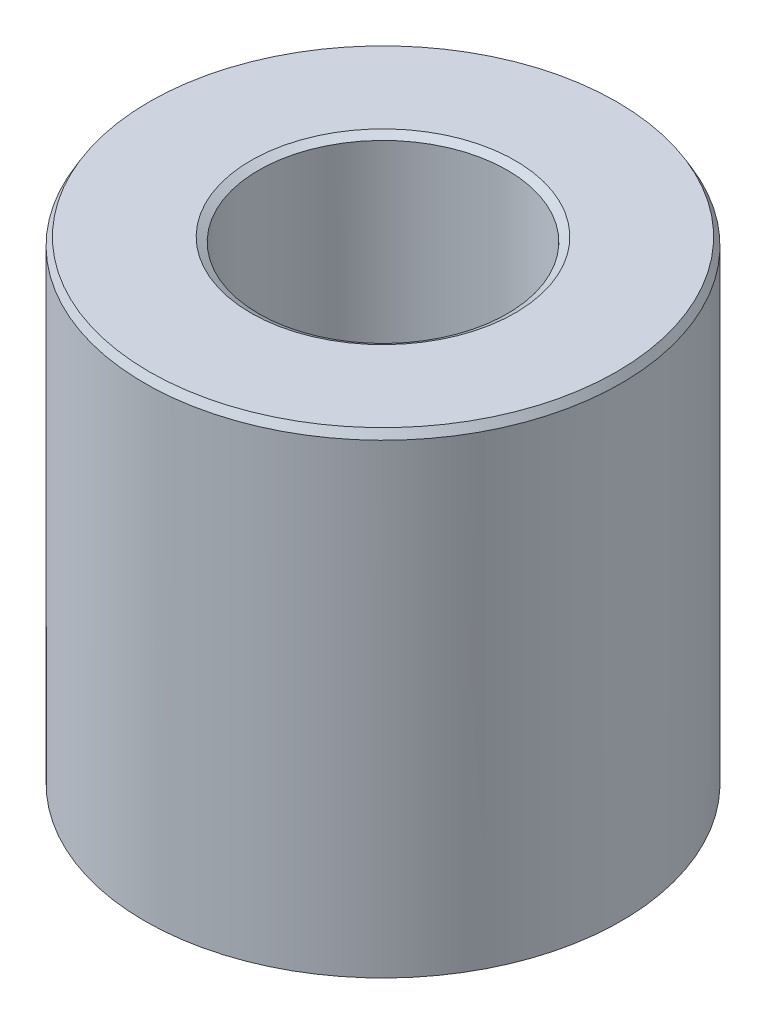
ISO-10303-21;
HEADER;
FILE_DESCRIPTION(('STEP AP214'),'2;1');
FILE_NAME('part.step','',(''),(''),'','','');
FILE_SCHEMA(('AUTOMOTIVE_DESIGN { 1 0 10303 214 1 1 1 1 }'));
ENDSEC;
DATA;
#1=APPLICATION_CONTEXT('core data for automotive mechanical design processes');
#2=APPLICATION_PROTOCOL_DEFINITION('international standard','automotive_design',2000,#1);
#3=PRODUCT_CONTEXT('',#1,'mechanical');
#4=PRODUCT('Part','Part','',(#3));
#5=PRODUCT_RELATED_PRODUCT_CATEGORY('part','',(#4));
#6=PRODUCT_DEFINITION_FORMATION('','',#4);
#7=PRODUCT_DEFINITION_CONTEXT('part definition',#1,'design');
#8=PRODUCT_DEFINITION('design','',#6,#7);
#9=PRODUCT_DEFINITION_SHAPE('','',#8);
#10=(LENGTH_UNIT() NAMED_UNIT(*) SI_UNIT(.MILLI.,.METRE.));
#11=(NAMED_UNIT(*) PLANE_ANGLE_UNIT() SI_UNIT($,.RADIAN.));
#12=(NAMED_UNIT(*) SI_UNIT($,.STERADIAN.) SOLID_ANGLE_UNIT());
#13=UNCERTAINTY_MEASURE_WITH_UNIT(LENGTH_MEASURE(1.E-05),#10,'distance_accuracy_value','');
#14=(GEOMETRIC_REPRESENTATION_CONTEXT(3) GLOBAL_UNCERTAINTY_ASSIGNED_CONTEXT((#13)) GLOBAL_UNIT_ASSIGNED_CONTEXT((#10,
#11,#12)) REPRESENTATION_CONTEXT('',''));
#15=CARTESIAN_POINT('',(0.,0.,0.));
#16=DIRECTION('',(0.,0.,1.));
#17=DIRECTION('',(1.,0.,0.));
#18=AXIS2_PLACEMENT_3D('',#15,#16,#17);
#19=CARTESIAN_POINT('',(0.,40.1169196248375,0.));
#20=DIRECTION('',(0.,-1.,0.));
#21=DIRECTION('',(0.,0.,-1.));
#22=AXIS2_PLACEMENT_3D('',#19,#20,#21);
#23=CYLINDRICAL_SURFACE('',#22,20.);
#24=CARTESIAN_POINT('',(0.,0.376915681253441,0.));
#25=DIRECTION('',(0.,1.,0.));
#26=DIRECTION('',(0.,0.,1.));
#27=AXIS2_PLACEMENT_3D('',#24,#25,#26);
#28=CIRCLE('',#27,20.);
#29=CARTESIAN_POINT('',(0.,0.376915681253441,-20.));
#30=VERTEX_POINT('',#29);
#31=EDGE_CURVE('E10',#30,#30,#28,.T.);
#32=CARTESIAN_POINT('',(0.,39.4640825147372,0.));
#33=DIRECTION('',(0.,1.,0.));
#34=DIRECTION('',(0.,0.,1.));
#35=AXIS2_PLACEMENT_3D('',#32,#33,#34);
#36=CIRCLE('',#35,20.);
#37=CARTESIAN_POINT('',(0.,39.4640825147372,-20.));
#38=VERTEX_POINT('',#37);
#39=EDGE_CURVE('E50',#38,#38,#36,.F.);
#40=CARTESIAN_POINT('',(0.,0.376915681253441,-20.));
#41=CARTESIAN_POINT('',(0.,0.784073669102231,-20.));
#42=CARTESIAN_POINT('',(0.,1.19123165695102,-20.));
#43=CARTESIAN_POINT('',(0.,2.0055476326486,-20.));
#44=CARTESIAN_POINT('',(0.,2.41270562049739,-20.));
#45=CARTESIAN_POINT('',(0.,3.22702159619497,-20.));
#46=CARTESIAN_POINT('',(0.,3.63417958404376,-20.));
#47=CARTESIAN_POINT('',(0.,4.44849555974134,-20.));
#48=CARTESIAN_POINT('',(0.,4.85565354759012,-20.));
#49=CARTESIAN_POINT('',(0.,5.6699695232877,-20.));
#50=CARTESIAN_POINT('',(0.,6.07712751113649,-20.));
#51=CARTESIAN_POINT('',(0.,6.89144348683407,-20.));
#52=CARTESIAN_POINT('',(0.,7.29860147468286,-20.));
#53=CARTESIAN_POINT('',(0.,8.11291745038044,-20.));
#54=CARTESIAN_POINT('',(0.,8.52007543822923,-20.));
#55=CARTESIAN_POINT('',(0.,9.3343914139268,-20.));
#56=CARTESIAN_POINT('',(0.,9.74154940177559,-20.));
#57=CARTESIAN_POINT('',(0.,10.5558653774732,-20.));
#58=CARTESIAN_POINT('',(0.,10.963023365322,-20.));
#59=CARTESIAN_POINT('',(0.,11.7773393410195,-20.));
#60=CARTESIAN_POINT('',(0.,12.1844973288683,-20.));
#61=CARTESIAN_POINT('',(0.,12.9988133045659,-20.));
#62=CARTESIAN_POINT('',(0.,13.4059712924147,-20.));
#63=CARTESIAN_POINT('',(0.,14.2202872681123,-20.));
#64=CARTESIAN_POINT('',(0.,14.6274452559611,-20.));
#65=CARTESIAN_POINT('',(0.,15.4417612316586,-20.));
#66=CARTESIAN_POINT('',(0.,15.8489192195074,-20.));
#67=CARTESIAN_POINT('',(0.,16.663235195205,-20.));
#68=CARTESIAN_POINT('',(0.,17.0703931830538,-20.));
#69=CARTESIAN_POINT('',(0.,17.8847091587514,-20.));
#70=CARTESIAN_POINT('',(0.,18.2918671466002,-20.));
#71=CARTESIAN_POINT('',(0.,19.1061831222977,-20.));
#72=CARTESIAN_POINT('',(0.,19.5133411101465,-20.));
#73=CARTESIAN_POINT('',(0.,20.3276570858441,-20.));
#74=CARTESIAN_POINT('',(0.,20.7348150736929,-20.));
#75=CARTESIAN_POINT('',(0.,21.5491310493905,-20.));
#76=CARTESIAN_POINT('',(0.,21.9562890372393,-20.));
#77=CARTESIAN_POINT('',(0.,22.7706050129369,-20.));
#78=CARTESIAN_POINT('',(0.,23.1777630007856,-20.));
#79=CARTESIAN_POINT('',(0.,23.9920789764832,-20.));
#80=CARTESIAN_POINT('',(0.,24.399236964332,-20.));
#81=CARTESIAN_POINT('',(0.,25.2135529400296,-20.));
#82=CARTESIAN_POINT('',(0.,25.6207109278784,-20.));
#83=CARTESIAN_POINT('',(0.,26.435026903576,-20.));
#84=CARTESIAN_POINT('',(0.,26.8421848914247,-20.));
#85=CARTESIAN_POINT('',(0.,27.6565008671223,-20.));
#86=CARTESIAN_POINT('',(0.,28.0636588549711,-20.));
#87=CARTESIAN_POINT('',(0.,28.8779748306687,-20.));
#88=CARTESIAN_POINT('',(0.,29.2851328185175,-20.));
#89=CARTESIAN_POINT('',(0.,30.0994487942151,-20.));
#90=CARTESIAN_POINT('',(0.,30.5066067820638,-20.));
#91=CARTESIAN_POINT('',(0.,31.3209227577614,-20.));
#92=CARTESIAN_POINT('',(0.,31.7280807456102,-20.));
#93=CARTESIAN_POINT('',(0.,32.5423967213078,-20.));
#94=CARTESIAN_POINT('',(0.,32.9495547091566,-20.));
#95=CARTESIAN_POINT('',(0.,33.7638706848542,-20.));
#96=CARTESIAN_POINT('',(0.,34.1710286727029,-20.));
#97=CARTESIAN_POINT('',(0.,34.9853446484005,-20.));
#98=CARTESIAN_POINT('',(0.,35.3925026362493,-20.));
#99=CARTESIAN_POINT('',(0.,36.2068186119469,-20.));
#100=CARTESIAN_POINT('',(0.,36.6139765997957,-20.));
#101=CARTESIAN_POINT('',(0.,37.4282925754933,-20.));
#102=CARTESIAN_POINT('',(0.,37.8354505633421,-20.));
#103=CARTESIAN_POINT('',(0.,38.6497665390396,-20.));
#104=CARTESIAN_POINT('',(0.,39.0569245268884,-20.));
#105=CARTESIAN_POINT('',(0.,39.4640825147372,-20.));
#106=B_SPLINE_CURVE_WITH_KNOTS('',3,(#40,#41,#42,#43,#44,#45,#46,#47,#48,#49,#50,#51,#52,#53,
#54,#55,#56,#57,#58,#59,#60,#61,#62,#63,#64,#65,#66,#67,#68,#69,#70,#71,#72,#73,#74,#75,#76,#77,
#78,#79,#80,#81,#82,#83,#84,#85,#86,#87,#88,#89,#90,#91,#92,#93,#94,#95,#96,#97,#98,#99,#100,
#101,#102,#103,#104,#105),.UNSPECIFIED.,.F.,.F.,(4,2,2,2,2,2,2,2,2,2,2,2,2,2,2,2,2,2,2,2,2,2,2,
2,2,2,2,2,2,2,2,2,4),(0.,1.22147396354637,2.44294792709274,3.66442189063911,4.88589585418547,
6.10736981773184,7.32884378127821,8.55031774482457,9.77179170837094,10.9932656719173,
12.2147396354637,13.43621359901,14.6576875625564,15.8791615261028,17.1006354896491,
18.3221094531955,19.5435834167419,20.7650573802883,21.9865313438346,23.208005307381,
24.4294792709274,25.6509532344737,26.8724271980201,28.0939011615665,29.3153751251128,
30.5368490886592,31.7583230522056,32.9797970157519,34.2012709792983,35.4227449428447,
36.644218906391,37.8656928699374,39.0871668334838),.UNSPECIFIED.);
#107=EDGE_CURVE('BSEAM39',#30,#38,#106,.T.);
#108=ORIENTED_EDGE('',*,*,#31,.T.);
#109=ORIENTED_EDGE('',*,*,#39,.T.);
#110=ORIENTED_EDGE('',*,*,#107,.T.);
#111=ORIENTED_EDGE('',*,*,#107,.F.);
#112=EDGE_LOOP('',(#108,#110,#109,#111));
#113=FACE_BOUND('',#112,.T.);
#114=ADVANCED_FACE('F39',(#113),#23,.T.);
#115=CARTESIAN_POINT('',(0.,40.1169196248375,0.));
#116=DIRECTION('',(0.,1.,0.));
#117=DIRECTION('',(0.,0.,1.));
#118=AXIS2_PLACEMENT_3D('',#115,#116,#117);
#119=PLANE('',#118);
#120=CARTESIAN_POINT('',(0.,40.1169196248375,0.));
#121=DIRECTION('',(0.,1.,0.));
#122=DIRECTION('',(0.,0.,1.));
#123=AXIS2_PLACEMENT_3D('',#120,#121,#122);
#124=CIRCLE('',#123,11.0907121372316);
#125=CARTESIAN_POINT('',(0.,40.1169196248375,11.0907121372316));
#126=VERTEX_POINT('',#125);
#127=EDGE_CURVE('E58',#126,#126,#124,.F.);
#128=ORIENTED_EDGE('',*,*,#127,.T.);
#129=EDGE_LOOP('',(#128));
#130=FACE_BOUND('',#129,.T.);
#131=CARTESIAN_POINT('',(0.,40.1169196248375,0.));
#132=DIRECTION('',(0.,1.,0.));
#133=DIRECTION('',(0.,0.,1.));
#134=AXIS2_PLACEMENT_3D('',#131,#132,#133);
#135=CIRCLE('',#134,19.6230843187466);
#136=CARTESIAN_POINT('',(0.,40.1169196248375,19.6230843187466));
#137=VERTEX_POINT('',#136);
#138=EDGE_CURVE('E61',#137,#137,#135,.T.);
#139=ORIENTED_EDGE('',*,*,#138,.T.);
#140=EDGE_LOOP('',(#139));
#141=FACE_BOUND('',#140,.T.);
#142=ADVANCED_FACE('F88',(#130,#141),#119,.T.);
#143=CARTESIAN_POINT('',(0.,0.,0.));
#144=DIRECTION('',(0.,1.,0.));
#145=DIRECTION('',(0.,0.,1.));
#146=AXIS2_PLACEMENT_3D('',#143,#144,#145);
#147=PLANE('',#146);
#148=CARTESIAN_POINT('',(0.,0.,0.));
#149=DIRECTION('',(0.,1.,0.));
#150=DIRECTION('',(0.,0.,1.));
#151=AXIS2_PLACEMENT_3D('',#148,#149,#150);
#152=CIRCLE('',#151,10.8147907083846);
#153=CARTESIAN_POINT('',(0.,0.,10.8147907083846));
#154=VERTEX_POINT('',#153);
#155=EDGE_CURVE('E51',#154,#154,#152,.T.);
#156=ORIENTED_EDGE('',*,*,#155,.T.);
#157=EDGE_LOOP('',(#156));
#158=FACE_BOUND('',#157,.T.);
#159=CARTESIAN_POINT('',(0.,0.,0.));
#160=DIRECTION('',(0.,1.,0.));
#161=DIRECTION('',(0.,0.,1.));
#162=AXIS2_PLACEMENT_3D('',#159,#160,#161);
#163=CIRCLE('',#162,19.3471628898996);
#164=CARTESIAN_POINT('',(0.,0.,19.3471628898996));
#165=VERTEX_POINT('',#164);
#166=EDGE_CURVE('E54',#165,#165,#163,.F.);
#167=ORIENTED_EDGE('',*,*,#166,.T.);
#168=EDGE_LOOP('',(#167));
#169=FACE_BOUND('',#168,.T.);
#170=ADVANCED_FACE('F83',(#158,#169),#147,.F.);
#171=CARTESIAN_POINT('',(0.,40.1169196248375,0.));
#172=DIRECTION('',(0.,-1.,0.));
#173=DIRECTION('',(0.,0.,-1.));
#174=AXIS2_PLACEMENT_3D('',#171,#172,#173);
#175=CYLINDRICAL_SURFACE('',#174,10.4378750271312);
#176=CARTESIAN_POINT('',(0.,39.7400039435841,0.));
#177=DIRECTION('',(0.,1.,0.));
#178=DIRECTION('',(0.,0.,1.));
#179=AXIS2_PLACEMENT_3D('',#176,#177,#178);
#180=CIRCLE('',#179,10.4378750271312);
#181=CARTESIAN_POINT('',(0.,39.7400039435841,-10.4378750271312));
#182=VERTEX_POINT('',#181);
#183=EDGE_CURVE('E67',#182,#182,#180,.T.);
#184=CARTESIAN_POINT('',(0.,0.652837110100342,0.));
#185=DIRECTION('',(0.,1.,0.));
#186=DIRECTION('',(0.,0.,1.));
#187=AXIS2_PLACEMENT_3D('',#184,#185,#186);
#188=CIRCLE('',#187,10.4378750271312);
#189=CARTESIAN_POINT('',(0.,0.652837110100342,-10.4378750271312));
#190=VERTEX_POINT('',#189);
#191=EDGE_CURVE('E69',#190,#190,#188,.F.);
#192=CARTESIAN_POINT('',(0.,39.7400039435841,-10.4378750271312));
#193=CARTESIAN_POINT('',(0.,39.3328459557353,-10.4378750271312));
#194=CARTESIAN_POINT('',(0.,38.9256879678865,-10.4378750271312));
#195=CARTESIAN_POINT('',(0.,38.1113719921889,-10.4378750271312));
#196=CARTESIAN_POINT('',(0.,37.7042140043401,-10.4378750271312));
#197=CARTESIAN_POINT('',(0.,36.8898980286425,-10.4378750271312));
#198=CARTESIAN_POINT('',(0.,36.4827400407938,-10.4378750271312));
#199=CARTESIAN_POINT('',(0.,35.6684240650962,-10.4378750271312));
#200=CARTESIAN_POINT('',(0.,35.2612660772474,-10.4378750271312));
#201=CARTESIAN_POINT('',(0.,34.4469501015498,-10.4378750271312));
#202=CARTESIAN_POINT('',(0.,34.039792113701,-10.4378750271312));
#203=CARTESIAN_POINT('',(0.,33.2254761380035,-10.4378750271312));
#204=CARTESIAN_POINT('',(0.,32.8183181501547,-10.4378750271312));
#205=CARTESIAN_POINT('',(0.,32.0040021744571,-10.4378750271312));
#206=CARTESIAN_POINT('',(0.,31.5968441866083,-10.4378750271312));
#207=CARTESIAN_POINT('',(0.,30.7825282109107,-10.4378750271312));
#208=CARTESIAN_POINT('',(0.,30.3753702230619,-10.4378750271312));
#209=CARTESIAN_POINT('',(0.,29.5610542473643,-10.4378750271312));
#210=CARTESIAN_POINT('',(0.,29.1538962595156,-10.4378750271312));
#211=CARTESIAN_POINT('',(0.,28.339580283818,-10.4378750271312));
#212=CARTESIAN_POINT('',(0.,27.9324222959692,-10.4378750271312));
#213=CARTESIAN_POINT('',(0.,27.1181063202716,-10.4378750271312));
#214=CARTESIAN_POINT('',(0.,26.7109483324228,-10.4378750271312));
#215=CARTESIAN_POINT('',(0.,25.8966323567253,-10.4378750271312));
#216=CARTESIAN_POINT('',(0.,25.4894743688765,-10.4378750271312));
#217=CARTESIAN_POINT('',(0.,24.6751583931789,-10.4378750271312));
#218=CARTESIAN_POINT('',(0.,24.2680004053301,-10.4378750271312));
#219=CARTESIAN_POINT('',(0.,23.4536844296325,-10.4378750271312));
#220=CARTESIAN_POINT('',(0.,23.0465264417837,-10.4378750271312));
#221=CARTESIAN_POINT('',(0.,22.2322104660862,-10.4378750271312));
#222=CARTESIAN_POINT('',(0.,21.8250524782374,-10.4378750271312));
#223=CARTESIAN_POINT('',(0.,21.0107365025398,-10.4378750271312));
#224=CARTESIAN_POINT('',(0.,20.603578514691,-10.4378750271312));
#225=CARTESIAN_POINT('',(0.,19.7892625389934,-10.4378750271312));
#226=CARTESIAN_POINT('',(0.,19.3821045511446,-10.4378750271312));
#227=CARTESIAN_POINT('',(0.,18.5677885754471,-10.4378750271312));
#228=CARTESIAN_POINT('',(0.,18.1606305875983,-10.4378750271312));
#229=CARTESIAN_POINT('',(0.,17.3463146119007,-10.4378750271312));
#230=CARTESIAN_POINT('',(0.,16.9391566240519,-10.4378750271312));
#231=CARTESIAN_POINT('',(0.,16.1248406483543,-10.4378750271312));
#232=CARTESIAN_POINT('',(0.,15.7176826605055,-10.4378750271312));
#233=CARTESIAN_POINT('',(0.,14.903366684808,-10.4378750271312));
#234=CARTESIAN_POINT('',(0.,14.4962086969592,-10.4378750271312));
#235=CARTESIAN_POINT('',(0.,13.6818927212616,-10.4378750271312));
#236=CARTESIAN_POINT('',(0.,13.2747347334128,-10.4378750271312));
#237=CARTESIAN_POINT('',(0.,12.4604187577152,-10.4378750271312));
#238=CARTESIAN_POINT('',(0.,12.0532607698664,-10.4378750271312));
#239=CARTESIAN_POINT('',(0.,11.2389447941689,-10.4378750271312));
#240=CARTESIAN_POINT('',(0.,10.8317868063201,-10.4378750271312));
#241=CARTESIAN_POINT('',(0.,10.0174708306225,-10.4378750271312));
#242=CARTESIAN_POINT('',(0.,9.61031284277369,-10.4378750271312));
#243=CARTESIAN_POINT('',(0.,8.79599686707612,-10.4378750271312));
#244=CARTESIAN_POINT('',(0.,8.38883887922733,-10.4378750271312));
#245=CARTESIAN_POINT('',(0.,7.57452290352975,-10.4378750271312));
#246=CARTESIAN_POINT('',(0.,7.16736491568097,-10.4378750271312));
#247=CARTESIAN_POINT('',(0.,6.35304893998339,-10.4378750271312));
#248=CARTESIAN_POINT('',(0.,5.94589095213461,-10.4378750271312));
#249=CARTESIAN_POINT('',(0.,5.13157497643703,-10.4378750271312));
#250=CARTESIAN_POINT('',(0.,4.72441698858824,-10.4378750271312));
#251=CARTESIAN_POINT('',(0.,3.91010101289066,-10.4378750271312));
#252=CARTESIAN_POINT('',(0.,3.50294302504187,-10.4378750271312));
#253=CARTESIAN_POINT('',(0.,2.68862704934429,-10.4378750271312));
#254=CARTESIAN_POINT('',(0.,2.2814690614955,-10.4378750271312));
#255=CARTESIAN_POINT('',(0.,1.46715308579792,-10.4378750271312));
#256=CARTESIAN_POINT('',(0.,1.05999509794913,-10.4378750271312));
#257=CARTESIAN_POINT('',(0.,0.652837110100342,-10.4378750271312));
#258=B_SPLINE_CURVE_WITH_KNOTS('',3,(#192,#193,#194,#195,#196,#197,#198,#199,#200,#201,#202,
#203,#204,#205,#206,#207,#208,#209,#210,#211,#212,#213,#214,#215,#216,#217,#218,#219,#220,#221,
#222,#223,#224,#225,#226,#227,#228,#229,#230,#231,#232,#233,#234,#235,#236,#237,#238,#239,#240,
#241,#242,#243,#244,#245,#246,#247,#248,#249,#250,#251,#252,#253,#254,#255,#256,#257),
.UNSPECIFIED.,.F.,.F.,(4,2,2,2,2,2,2,2,2,2,2,2,2,2,2,2,2,2,2,2,2,2,2,2,2,2,2,2,2,2,2,2,4),(0.,
1.22147396354637,2.44294792709274,3.66442189063911,4.88589585418547,6.10736981773184,
7.3288437812782,8.55031774482457,9.77179170837093,10.9932656719173,12.2147396354637,
13.43621359901,14.6576875625564,15.8791615261028,17.1006354896491,18.3221094531955,
19.5435834167419,20.7650573802882,21.9865313438346,23.208005307381,24.4294792709273,
25.6509532344737,26.8724271980201,28.0939011615664,29.3153751251128,30.5368490886592,
31.7583230522055,32.9797970157519,34.2012709792983,35.4227449428446,36.644218906391,
37.8656928699374,39.0871668334837),.UNSPECIFIED.);
#259=EDGE_CURVE('BSEAM71',#182,#190,#258,.T.);
#260=ORIENTED_EDGE('',*,*,#183,.T.);
#261=ORIENTED_EDGE('',*,*,#191,.T.);
#262=ORIENTED_EDGE('',*,*,#259,.T.);
#263=ORIENTED_EDGE('',*,*,#259,.F.);
#264=EDGE_LOOP('',(#260,#262,#261,#263));
#265=FACE_BOUND('',#264,.T.);
#266=ADVANCED_FACE('F71',(#265),#175,.F.);
#267=CARTESIAN_POINT('',(0.,39.7400039435841,0.));
#268=DIRECTION('',(0.,1.,0.));
#269=DIRECTION('',(0.,0.,1.));
#270=AXIS2_PLACEMENT_3D('',#267,#268,#269);
#271=CONICAL_SURFACE('',#270,10.4378750271312,1.0471975511966);
#272=ORIENTED_EDGE('',*,*,#127,.F.);
#273=EDGE_LOOP('',(#272));
#274=FACE_BOUND('',#273,.T.);
#275=ORIENTED_EDGE('',*,*,#183,.F.);
#276=EDGE_LOOP('',(#275));
#277=FACE_BOUND('',#276,.T.);
#278=ADVANCED_FACE('F77',(#274,#277),#271,.F.);
#279=CARTESIAN_POINT('',(0.,0.,0.));
#280=DIRECTION('',(0.,-1.,0.));
#281=DIRECTION('',(0.,0.,-1.));
#282=AXIS2_PLACEMENT_3D('',#279,#280,#281);
#283=CONICAL_SURFACE('',#282,10.8147907083846,0.523598775598293);
#284=ORIENTED_EDGE('',*,*,#191,.F.);
#285=EDGE_LOOP('',(#284));
#286=FACE_BOUND('',#285,.T.);
#287=ORIENTED_EDGE('',*,*,#155,.F.);
#288=EDGE_LOOP('',(#287));
#289=FACE_BOUND('',#288,.T.);
#290=ADVANCED_FACE('F73',(#286,#289),#283,.F.);
#291=CARTESIAN_POINT('',(0.,0.376915681253441,0.));
#292=DIRECTION('',(0.,1.,0.));
#293=DIRECTION('',(0.,0.,1.));
#294=AXIS2_PLACEMENT_3D('',#291,#292,#293);
#295=CONICAL_SURFACE('',#294,20.,1.0471975511966);
#296=ORIENTED_EDGE('',*,*,#166,.F.);
#297=EDGE_LOOP('',(#296));
#298=FACE_BOUND('',#297,.T.);
#299=ORIENTED_EDGE('',*,*,#31,.F.);
#300=EDGE_LOOP('',(#299));
#301=FACE_BOUND('',#300,.T.);
#302=ADVANCED_FACE('F76',(#298,#301),#295,.T.);
#303=CARTESIAN_POINT('',(0.,40.1169196248375,0.));
#304=DIRECTION('',(0.,-1.,0.));
#305=DIRECTION('',(0.,0.,-1.));
#306=AXIS2_PLACEMENT_3D('',#303,#304,#305);
#307=CONICAL_SURFACE('',#306,19.6230843187466,0.523598775598295);
#308=ORIENTED_EDGE('',*,*,#39,.F.);
#309=EDGE_LOOP('',(#308));
#310=FACE_BOUND('',#309,.T.);
#311=ORIENTED_EDGE('',*,*,#138,.F.);
#312=EDGE_LOOP('',(#311));
#313=FACE_BOUND('',#312,.T.);
#314=ADVANCED_FACE('F45',(#310,#313),#307,.T.);
#315=CLOSED_SHELL('',(#114,#142,#170,#266,#278,#290,#302,#314));
#316=MANIFOLD_SOLID_BREP('B2',#315);
#317=ADVANCED_BREP_SHAPE_REPRESENTATION('',(#18,#316),#14);
#318=SHAPE_DEFINITION_REPRESENTATION(#9,#317);
ENDSEC;
END-ISO-10303-21;
